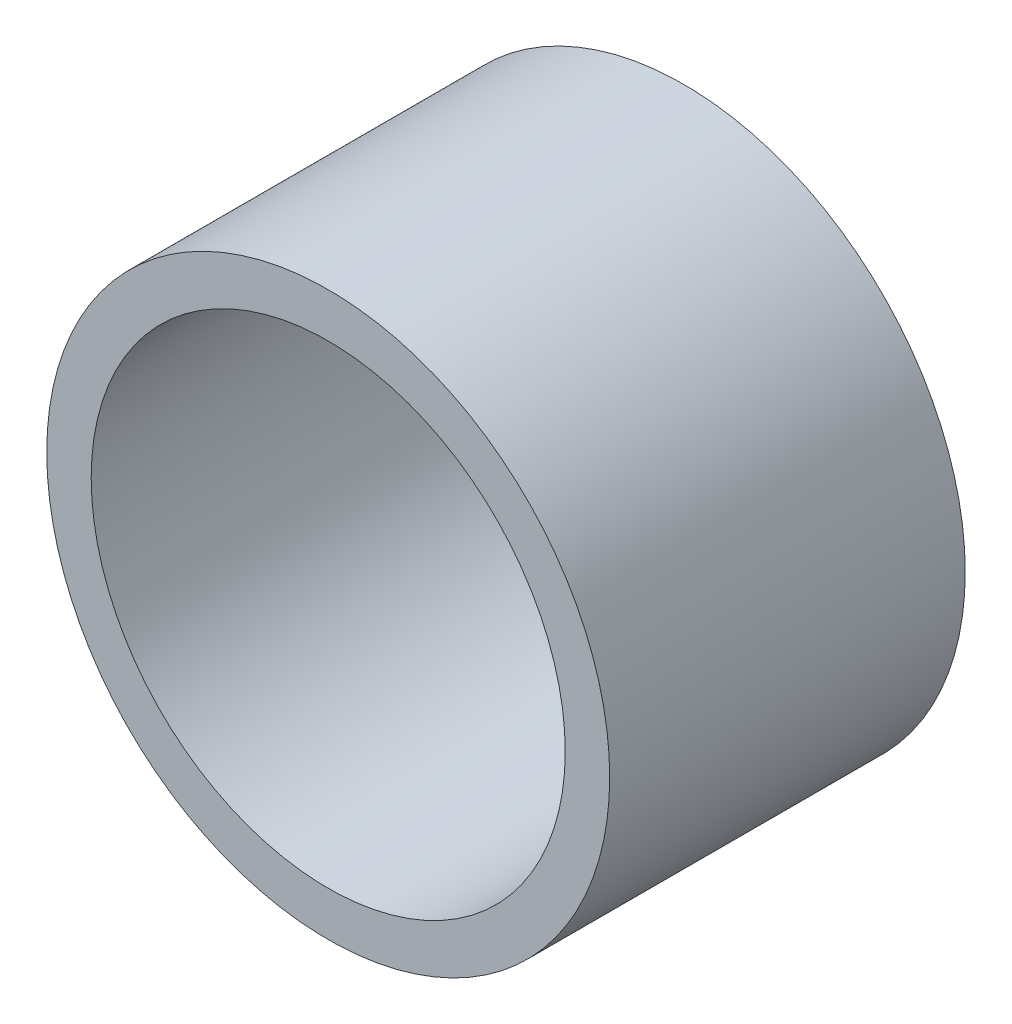
ISO-10303-21;
HEADER;
FILE_DESCRIPTION(('STEP AP214'),'2;1');
FILE_NAME('part.step','',(''),(''),'','','');
FILE_SCHEMA(('AUTOMOTIVE_DESIGN { 1 0 10303 214 1 1 1 1 }'));
ENDSEC;
DATA;
#1=APPLICATION_CONTEXT('core data for automotive mechanical design processes');
#2=APPLICATION_PROTOCOL_DEFINITION('international standard','automotive_design',2000,#1);
#3=PRODUCT_CONTEXT('',#1,'mechanical');
#4=PRODUCT('Part','Part','',(#3));
#5=PRODUCT_RELATED_PRODUCT_CATEGORY('part','',(#4));
#6=PRODUCT_DEFINITION_FORMATION('','',#4);
#7=PRODUCT_DEFINITION_CONTEXT('part definition',#1,'design');
#8=PRODUCT_DEFINITION('design','',#6,#7);
#9=PRODUCT_DEFINITION_SHAPE('','',#8);
#10=(LENGTH_UNIT() NAMED_UNIT(*) SI_UNIT(.MILLI.,.METRE.));
#11=(NAMED_UNIT(*) PLANE_ANGLE_UNIT() SI_UNIT($,.RADIAN.));
#12=(NAMED_UNIT(*) SI_UNIT($,.STERADIAN.) SOLID_ANGLE_UNIT());
#13=UNCERTAINTY_MEASURE_WITH_UNIT(LENGTH_MEASURE(1.E-05),#10,'distance_accuracy_value','');
#14=(GEOMETRIC_REPRESENTATION_CONTEXT(3) GLOBAL_UNCERTAINTY_ASSIGNED_CONTEXT((#13)) GLOBAL_UNIT_ASSIGNED_CONTEXT((#10,
#11,#12)) REPRESENTATION_CONTEXT('',''));
#15=CARTESIAN_POINT('',(0.,0.,0.));
#16=DIRECTION('',(0.,0.,1.));
#17=DIRECTION('',(1.,0.,0.));
#18=AXIS2_PLACEMENT_3D('',#15,#16,#17);
#19=CARTESIAN_POINT('',(0.,0.,19.05));
#20=DIRECTION('',(0.,0.,1.));
#21=DIRECTION('',(1.,0.,0.));
#22=AXIS2_PLACEMENT_3D('',#19,#20,#21);
#23=PLANE('',#22);
#24=CARTESIAN_POINT('',(0.,0.,19.05));
#25=DIRECTION('',(0.,0.,1.));
#26=DIRECTION('',(1.,0.,0.));
#27=AXIS2_PLACEMENT_3D('',#24,#25,#26);
#28=CIRCLE('',#27,30.1625);
#29=CARTESIAN_POINT('',(30.1625,0.,19.05));
#30=VERTEX_POINT('',#29);
#31=EDGE_CURVE('E10',#30,#30,#28,.T.);
#32=ORIENTED_EDGE('',*,*,#31,.T.);
#33=EDGE_LOOP('',(#32));
#34=FACE_BOUND('',#33,.T.);
#35=CARTESIAN_POINT('',(0.,0.,19.05));
#36=DIRECTION('',(0.,0.,1.));
#37=DIRECTION('',(1.,0.,0.));
#38=AXIS2_PLACEMENT_3D('',#35,#36,#37);
#39=CIRCLE('',#38,25.4);
#40=CARTESIAN_POINT('',(25.4,0.,19.05));
#41=VERTEX_POINT('',#40);
#42=EDGE_CURVE('E41',#41,#41,#39,.T.);
#43=ORIENTED_EDGE('',*,*,#42,.F.);
#44=EDGE_LOOP('',(#43));
#45=FACE_BOUND('',#44,.T.);
#46=ADVANCED_FACE('F30',(#34,#45),#23,.T.);
#47=CARTESIAN_POINT('',(0.,0.,-19.05));
#48=DIRECTION('',(0.,0.,1.));
#49=DIRECTION('',(1.,0.,0.));
#50=AXIS2_PLACEMENT_3D('',#47,#48,#49);
#51=PLANE('',#50);
#52=CARTESIAN_POINT('',(0.,0.,-19.05));
#53=DIRECTION('',(0.,0.,1.));
#54=DIRECTION('',(1.,0.,0.));
#55=AXIS2_PLACEMENT_3D('',#52,#53,#54);
#56=CIRCLE('',#55,30.1625);
#57=CARTESIAN_POINT('',(30.1625,0.,-19.05));
#58=VERTEX_POINT('',#57);
#59=EDGE_CURVE('E34',#58,#58,#56,.T.);
#60=ORIENTED_EDGE('',*,*,#59,.F.);
#61=EDGE_LOOP('',(#60));
#62=FACE_BOUND('',#61,.T.);
#63=CARTESIAN_POINT('',(0.,0.,-19.05));
#64=DIRECTION('',(0.,0.,1.));
#65=DIRECTION('',(1.,0.,0.));
#66=AXIS2_PLACEMENT_3D('',#63,#64,#65);
#67=CIRCLE('',#66,25.4);
#68=CARTESIAN_POINT('',(25.4,0.,-19.05));
#69=VERTEX_POINT('',#68);
#70=EDGE_CURVE('E43',#69,#69,#67,.T.);
#71=ORIENTED_EDGE('',*,*,#70,.T.);
#72=EDGE_LOOP('',(#71));
#73=FACE_BOUND('',#72,.T.);
#74=ADVANCED_FACE('F53',(#62,#73),#51,.F.);
#75=CARTESIAN_POINT('',(0.,0.,19.05));
#76=DIRECTION('',(0.,0.,-1.));
#77=DIRECTION('',(-1.,0.,0.));
#78=AXIS2_PLACEMENT_3D('',#75,#76,#77);
#79=CYLINDRICAL_SURFACE('',#78,30.1625);
#80=ORIENTED_EDGE('',*,*,#31,.F.);
#81=EDGE_LOOP('',(#80));
#82=FACE_BOUND('',#81,.T.);
#83=ORIENTED_EDGE('',*,*,#59,.T.);
#84=EDGE_LOOP('',(#83));
#85=FACE_BOUND('',#84,.T.);
#86=ADVANCED_FACE('F32',(#82,#85),#79,.T.);
#87=CARTESIAN_POINT('',(0.,0.,19.05));
#88=DIRECTION('',(0.,0.,-1.));
#89=DIRECTION('',(-1.,0.,0.));
#90=AXIS2_PLACEMENT_3D('',#87,#88,#89);
#91=CYLINDRICAL_SURFACE('',#90,25.4);
#92=ORIENTED_EDGE('',*,*,#42,.T.);
#93=EDGE_LOOP('',(#92));
#94=FACE_BOUND('',#93,.T.);
#95=ORIENTED_EDGE('',*,*,#70,.F.);
#96=EDGE_LOOP('',(#95));
#97=FACE_BOUND('',#96,.T.);
#98=ADVANCED_FACE('F49',(#94,#97),#91,.F.);
#99=CLOSED_SHELL('',(#46,#74,#86,#98));
#100=MANIFOLD_SOLID_BREP('B2',#99);
#101=ADVANCED_BREP_SHAPE_REPRESENTATION('',(#18,#100),#14);
#102=SHAPE_DEFINITION_REPRESENTATION(#9,#101);
ENDSEC;
END-ISO-10303-21;
